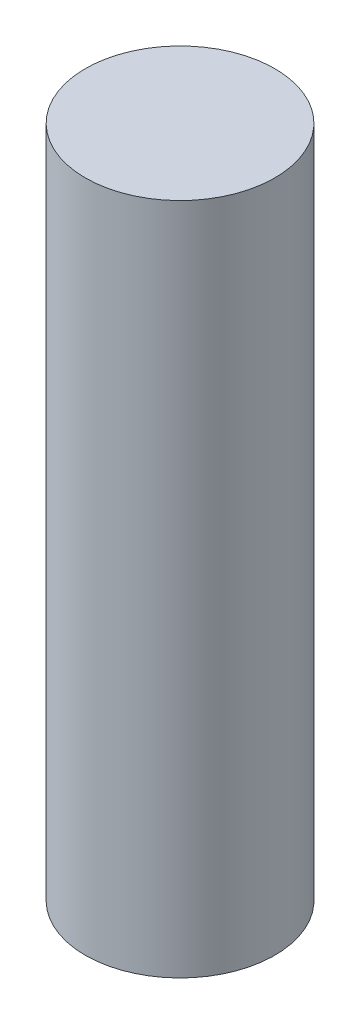
ISO-10303-21;
HEADER;
FILE_DESCRIPTION(('STEP AP214'),'2;1');
FILE_NAME('part.step','',(''),(''),'','','');
FILE_SCHEMA(('AUTOMOTIVE_DESIGN { 1 0 10303 214 1 1 1 1 }'));
ENDSEC;
DATA;
#1=APPLICATION_CONTEXT('core data for automotive mechanical design processes');
#2=APPLICATION_PROTOCOL_DEFINITION('international standard','automotive_design',2000,#1);
#3=PRODUCT_CONTEXT('',#1,'mechanical');
#4=PRODUCT('Part','Part','',(#3));
#5=PRODUCT_RELATED_PRODUCT_CATEGORY('part','',(#4));
#6=PRODUCT_DEFINITION_FORMATION('','',#4);
#7=PRODUCT_DEFINITION_CONTEXT('part definition',#1,'design');
#8=PRODUCT_DEFINITION('design','',#6,#7);
#9=PRODUCT_DEFINITION_SHAPE('','',#8);
#10=(LENGTH_UNIT() NAMED_UNIT(*) SI_UNIT(.MILLI.,.METRE.));
#11=(NAMED_UNIT(*) PLANE_ANGLE_UNIT() SI_UNIT($,.RADIAN.));
#12=(NAMED_UNIT(*) SI_UNIT($,.STERADIAN.) SOLID_ANGLE_UNIT());
#13=UNCERTAINTY_MEASURE_WITH_UNIT(LENGTH_MEASURE(1.E-05),#10,'distance_accuracy_value','');
#14=(GEOMETRIC_REPRESENTATION_CONTEXT(3) GLOBAL_UNCERTAINTY_ASSIGNED_CONTEXT((#13)) GLOBAL_UNIT_ASSIGNED_CONTEXT((#10,
#11,#12)) REPRESENTATION_CONTEXT('',''));
#15=CARTESIAN_POINT('',(0.,0.,0.));
#16=DIRECTION('',(0.,0.,1.));
#17=DIRECTION('',(1.,0.,0.));
#18=AXIS2_PLACEMENT_3D('',#15,#16,#17);
#19=CARTESIAN_POINT('',(0.,65.05,0.));
#20=DIRECTION('',(0.,-1.,0.));
#21=DIRECTION('',(0.,0.,-1.));
#22=AXIS2_PLACEMENT_3D('',#19,#20,#21);
#23=CYLINDRICAL_SURFACE('',#22,9.15);
#24=CARTESIAN_POINT('',(0.,65.05,0.));
#25=DIRECTION('',(0.,1.,0.));
#26=DIRECTION('',(0.,0.,1.));
#27=AXIS2_PLACEMENT_3D('',#24,#25,#26);
#28=CIRCLE('',#27,9.15);
#29=CARTESIAN_POINT('',(0.,65.05,9.15));
#30=VERTEX_POINT('',#29);
#31=EDGE_CURVE('E10',#30,#30,#28,.T.);
#32=ORIENTED_EDGE('',*,*,#31,.F.);
#33=EDGE_LOOP('',(#32));
#34=FACE_BOUND('',#33,.T.);
#35=CARTESIAN_POINT('',(0.,0.,0.));
#36=DIRECTION('',(0.,1.,0.));
#37=DIRECTION('',(0.,0.,1.));
#38=AXIS2_PLACEMENT_3D('',#35,#36,#37);
#39=CIRCLE('',#38,9.15);
#40=CARTESIAN_POINT('',(0.,0.,9.15));
#41=VERTEX_POINT('',#40);
#42=EDGE_CURVE('E35',#41,#41,#39,.T.);
#43=ORIENTED_EDGE('',*,*,#42,.T.);
#44=EDGE_LOOP('',(#43));
#45=FACE_BOUND('',#44,.T.);
#46=ADVANCED_FACE('F32',(#34,#45),#23,.T.);
#47=CARTESIAN_POINT('',(0.,65.05,0.));
#48=DIRECTION('',(0.,1.,0.));
#49=DIRECTION('',(0.,0.,1.));
#50=AXIS2_PLACEMENT_3D('',#47,#48,#49);
#51=PLANE('',#50);
#52=ORIENTED_EDGE('',*,*,#31,.T.);
#53=EDGE_LOOP('',(#52));
#54=FACE_BOUND('',#53,.T.);
#55=ADVANCED_FACE('F47',(#54),#51,.T.);
#56=CARTESIAN_POINT('',(0.,0.,0.));
#57=DIRECTION('',(0.,1.,0.));
#58=DIRECTION('',(0.,0.,1.));
#59=AXIS2_PLACEMENT_3D('',#56,#57,#58);
#60=PLANE('',#59);
#61=ORIENTED_EDGE('',*,*,#42,.F.);
#62=EDGE_LOOP('',(#61));
#63=FACE_BOUND('',#62,.T.);
#64=ADVANCED_FACE('F45',(#63),#60,.F.);
#65=CLOSED_SHELL('',(#46,#55,#64));
#66=MANIFOLD_SOLID_BREP('B2',#65);
#67=ADVANCED_BREP_SHAPE_REPRESENTATION('',(#18,#66),#14);
#68=SHAPE_DEFINITION_REPRESENTATION(#9,#67);
ENDSEC;
END-ISO-10303-21;
